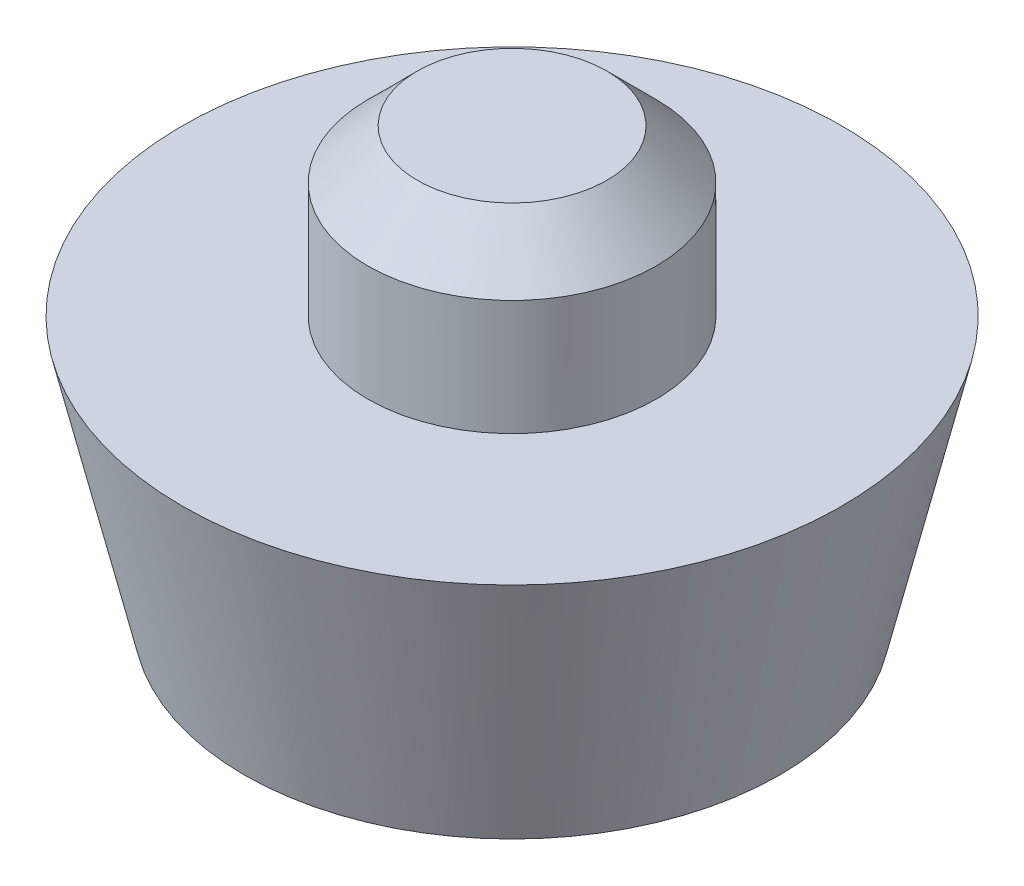
ISO-10303-21;
HEADER;
FILE_DESCRIPTION(('STEP AP214'),'2;1');
FILE_NAME('part.step','',(''),(''),'','','');
FILE_SCHEMA(('AUTOMOTIVE_DESIGN { 1 0 10303 214 1 1 1 1 }'));
ENDSEC;
DATA;
#1=APPLICATION_CONTEXT('core data for automotive mechanical design processes');
#2=APPLICATION_PROTOCOL_DEFINITION('international standard','automotive_design',2000,#1);
#3=PRODUCT_CONTEXT('',#1,'mechanical');
#4=PRODUCT('Part','Part','',(#3));
#5=PRODUCT_RELATED_PRODUCT_CATEGORY('part','',(#4));
#6=PRODUCT_DEFINITION_FORMATION('','',#4);
#7=PRODUCT_DEFINITION_CONTEXT('part definition',#1,'design');
#8=PRODUCT_DEFINITION('design','',#6,#7);
#9=PRODUCT_DEFINITION_SHAPE('','',#8);
#10=(LENGTH_UNIT() NAMED_UNIT(*) SI_UNIT(.MILLI.,.METRE.));
#11=(NAMED_UNIT(*) PLANE_ANGLE_UNIT() SI_UNIT($,.RADIAN.));
#12=(NAMED_UNIT(*) SI_UNIT($,.STERADIAN.) SOLID_ANGLE_UNIT());
#13=UNCERTAINTY_MEASURE_WITH_UNIT(LENGTH_MEASURE(1.E-05),#10,'distance_accuracy_value','');
#14=(GEOMETRIC_REPRESENTATION_CONTEXT(3) GLOBAL_UNCERTAINTY_ASSIGNED_CONTEXT((#13)) GLOBAL_UNIT_ASSIGNED_CONTEXT((#10,
#11,#12)) REPRESENTATION_CONTEXT('',''));
#15=CARTESIAN_POINT('',(0.,0.,0.));
#16=DIRECTION('',(0.,0.,1.));
#17=DIRECTION('',(1.,0.,0.));
#18=AXIS2_PLACEMENT_3D('',#15,#16,#17);
#19=CARTESIAN_POINT('',(-51.041194398403,-78.167296946049,-4.73));
#20=DIRECTION('',(0.,-1.,0.));
#21=DIRECTION('',(0.,0.,1.));
#22=AXIS2_PLACEMENT_3D('',#19,#20,#21);
#23=PLANE('',#22);
#24=CARTESIAN_POINT('',(-55.7711943984024,-78.1672969460494,5.76191659535264E-13));
#25=DIRECTION('',(0.,1.,-1.36023523358516E-13));
#26=DIRECTION('',(0.,1.36023523358516E-13,1.));
#27=AXIS2_PLACEMENT_3D('',#24,#25,#26);
#28=CIRCLE('',#27,4.30000000000064);
#29=CARTESIAN_POINT('',(-55.7711943984024,-78.1672969460489,4.30000000000122));
#30=VERTEX_POINT('',#29);
#31=EDGE_CURVE('E19',#30,#30,#28,.T.);
#32=ORIENTED_EDGE('',*,*,#31,.F.);
#33=EDGE_LOOP('',(#32));
#34=FACE_BOUND('',#33,.T.);
#35=ADVANCED_FACE('F15',(#34),#23,.T.);
#36=CARTESIAN_POINT('',(-58.301194398403,-66.967296946049,-2.53));
#37=DIRECTION('',(0.,1.,0.));
#38=DIRECTION('',(0.,0.,1.));
#39=AXIS2_PLACEMENT_3D('',#36,#37,#38);
#40=PLANE('',#39);
#41=CARTESIAN_POINT('',(-55.7711943984022,-66.9672969460494,3.84452430083598E-13));
#42=DIRECTION('',(0.,-1.,1.62536131825264E-13));
#43=DIRECTION('',(0.,-1.62536131825264E-13,-1.));
#44=AXIS2_PLACEMENT_3D('',#41,#42,#43);
#45=CIRCLE('',#44,2.30000000000098);
#46=CARTESIAN_POINT('',(-55.7711943984022,-66.9672969460498,-2.30000000000059));
#47=VERTEX_POINT('',#46);
#48=EDGE_CURVE('E39',#47,#47,#45,.T.);
#49=ORIENTED_EDGE('',*,*,#48,.F.);
#50=EDGE_LOOP('',(#49));
#51=FACE_BOUND('',#50,.T.);
#52=ADVANCED_FACE('F51',(#51),#40,.T.);
#53=CARTESIAN_POINT('',(-55.7711943984023,-77.4672969460495,4.8097519318432E-13));
#54=DIRECTION('',(0.,1.,-1.36023523358516E-13));
#55=DIRECTION('',(0.,1.36023523358516E-13,1.));
#56=AXIS2_PLACEMENT_3D('',#53,#54,#55);
#57=TOROIDAL_SURFACE('',#56,4.30000000000075,0.699999999999876);
#58=ORIENTED_EDGE('',*,*,#31,.T.);
#59=EDGE_LOOP('',(#58));
#60=FACE_BOUND('',#59,.T.);
#61=CARTESIAN_POINT('',(-55.7711943984023,-77.4672969460493,5.76842180838735E-13));
#62=DIRECTION('',(0.,1.,-1.15377761183006E-13));
#63=DIRECTION('',(0.,1.15377761183006E-13,1.));
#64=AXIS2_PLACEMENT_3D('',#61,#62,#63);
#65=CIRCLE('',#64,4.99999999999995);
#66=CARTESIAN_POINT('',(-55.7711943984023,-77.4672969460487,5.00000000000052));
#67=VERTEX_POINT('',#66);
#68=EDGE_CURVE('E31',#67,#67,#65,.T.);
#69=ORIENTED_EDGE('',*,*,#68,.F.);
#70=EDGE_LOOP('',(#69));
#71=FACE_BOUND('',#70,.T.);
#72=ADVANCED_FACE('F47',(#60,#71),#57,.T.);
#73=CARTESIAN_POINT('',(-55.7711943984023,-68.1672969460493,5.79495788273907E-13));
#74=DIRECTION('',(0.,-1.,1.62536131825264E-13));
#75=DIRECTION('',(0.,-1.62536131825264E-13,-1.));
#76=AXIS2_PLACEMENT_3D('',#73,#74,#75);
#77=CONICAL_SURFACE('',#76,3.5000000000007,0.785398163397353);
#78=CARTESIAN_POINT('',(-55.7711943984023,-68.1672969460493,5.79495788273908E-13));
#79=DIRECTION('',(0.,-1.,1.62536131825264E-13));
#80=DIRECTION('',(0.,-1.62536131825264E-13,-1.));
#81=AXIS2_PLACEMENT_3D('',#78,#79,#80);
#82=CIRCLE('',#81,3.49999999999994);
#83=CARTESIAN_POINT('',(-55.7711943984023,-68.1672969460499,-3.49999999999936));
#84=VERTEX_POINT('',#83);
#85=EDGE_CURVE('E38',#84,#84,#82,.T.);
#86=ORIENTED_EDGE('',*,*,#85,.F.);
#87=EDGE_LOOP('',(#86));
#88=FACE_BOUND('',#87,.T.);
#89=ORIENTED_EDGE('',*,*,#48,.T.);
#90=EDGE_LOOP('',(#89));
#91=FACE_BOUND('',#90,.T.);
#92=ADVANCED_FACE('F82',(#88,#91),#77,.T.);
#93=CARTESIAN_POINT('',(-55.7711943984023,-77.4672969460493,5.76842180838735E-13));
#94=DIRECTION('',(0.,1.,-1.15377761183006E-13));
#95=DIRECTION('',(0.,1.15377761183006E-13,1.));
#96=AXIS2_PLACEMENT_3D('',#93,#94,#95);
#97=CYLINDRICAL_SURFACE('',#96,4.99999999999995);
#98=ORIENTED_EDGE('',*,*,#68,.T.);
#99=EDGE_LOOP('',(#98));
#100=FACE_BOUND('',#99,.T.);
#101=CARTESIAN_POINT('',(-55.7711943984023,-77.3672969460513,5.65304404720667E-13));
#102=DIRECTION('',(0.,1.,-1.15377761183006E-13));
#103=DIRECTION('',(0.,1.15377761183006E-13,1.));
#104=AXIS2_PLACEMENT_3D('',#101,#102,#103);
#105=CIRCLE('',#104,4.99999999999995);
#106=CARTESIAN_POINT('',(-55.7711943984023,-77.3672969460508,5.00000000000051));
#107=VERTEX_POINT('',#106);
#108=EDGE_CURVE('E36',#107,#107,#105,.T.);
#109=ORIENTED_EDGE('',*,*,#108,.F.);
#110=EDGE_LOOP('',(#109));
#111=FACE_BOUND('',#110,.T.);
#112=ADVANCED_FACE('F76',(#100,#111),#97,.T.);
#113=CARTESIAN_POINT('',(-55.7711943984023,-70.9672969460493,5.79495788273908E-13));
#114=DIRECTION('',(0.,1.,-1.62536131825264E-13));
#115=DIRECTION('',(0.,1.62536131825264E-13,1.));
#116=AXIS2_PLACEMENT_3D('',#113,#114,#115);
#117=CYLINDRICAL_SURFACE('',#116,3.49999999999994);
#118=CARTESIAN_POINT('',(-55.7711943984023,-70.9672969460493,5.79495788273907E-13));
#119=DIRECTION('',(0.,1.,-1.62536131825264E-13));
#120=DIRECTION('',(0.,1.62536131825264E-13,1.));
#121=AXIS2_PLACEMENT_3D('',#118,#119,#120);
#122=CIRCLE('',#121,3.49999999999994);
#123=CARTESIAN_POINT('',(-55.7711943984023,-70.9672969460488,3.50000000000052));
#124=VERTEX_POINT('',#123);
#125=EDGE_CURVE('E28',#124,#124,#122,.F.);
#126=ORIENTED_EDGE('',*,*,#125,.F.);
#127=EDGE_LOOP('',(#126));
#128=FACE_BOUND('',#127,.T.);
#129=ORIENTED_EDGE('',*,*,#85,.T.);
#130=EDGE_LOOP('',(#129));
#131=FACE_BOUND('',#130,.T.);
#132=ADVANCED_FACE('F70',(#128,#131),#117,.T.);
#133=CARTESIAN_POINT('',(-48.621194398403,-77.367296946051,-7.15));
#134=DIRECTION('',(0.,-1.,0.));
#135=DIRECTION('',(0.,0.,1.));
#136=AXIS2_PLACEMENT_3D('',#133,#134,#135);
#137=PLANE('',#136);
#138=ORIENTED_EDGE('',*,*,#108,.T.);
#139=EDGE_LOOP('',(#138));
#140=FACE_BOUND('',#139,.T.);
#141=CARTESIAN_POINT('',(-55.7711943984023,-77.3672969460513,5.76842180838729E-13));
#142=DIRECTION('',(0.,1.,0.));
#143=DIRECTION('',(0.,0.,1.));
#144=AXIS2_PLACEMENT_3D('',#141,#142,#143);
#145=CIRCLE('',#144,6.50000000000073);
#146=CARTESIAN_POINT('',(-55.7711943984023,-77.3672969460508,6.5000000000013));
#147=VERTEX_POINT('',#146);
#148=EDGE_CURVE('E23',#147,#147,#145,.T.);
#149=ORIENTED_EDGE('',*,*,#148,.F.);
#150=EDGE_LOOP('',(#149));
#151=FACE_BOUND('',#150,.T.);
#152=ADVANCED_FACE('F65',(#140,#151),#137,.T.);
#153=CARTESIAN_POINT('',(-64.571194398403,-70.967296946049,-8.8));
#154=DIRECTION('',(0.,1.,0.));
#155=DIRECTION('',(0.,0.,1.));
#156=AXIS2_PLACEMENT_3D('',#153,#154,#155);
#157=PLANE('',#156);
#158=ORIENTED_EDGE('',*,*,#125,.T.);
#159=EDGE_LOOP('',(#158));
#160=FACE_BOUND('',#159,.T.);
#161=CARTESIAN_POINT('',(-55.7711943984019,-70.9672969460494,0.));
#162=DIRECTION('',(0.,1.,0.));
#163=DIRECTION('',(0.,0.,1.));
#164=AXIS2_PLACEMENT_3D('',#161,#162,#163);
#165=CIRCLE('',#164,8.00000000000105);
#166=CARTESIAN_POINT('',(-55.7711943984019,-70.9672969460487,8.00000000000106));
#167=VERTEX_POINT('',#166);
#168=EDGE_CURVE('E10',#167,#167,#165,.F.);
#169=ORIENTED_EDGE('',*,*,#168,.F.);
#170=EDGE_LOOP('',(#169));
#171=FACE_BOUND('',#170,.T.);
#172=ADVANCED_FACE('F60',(#160,#171),#157,.T.);
#173=CARTESIAN_POINT('',(-55.7711943984023,-77.3672969460513,5.76842180838729E-13));
#174=DIRECTION('',(0.,1.,0.));
#175=DIRECTION('',(0.,0.,1.));
#176=AXIS2_PLACEMENT_3D('',#173,#174,#175);
#177=CONICAL_SURFACE('',#176,6.50000000000073,0.230219587276825);
#178=ORIENTED_EDGE('',*,*,#148,.T.);
#179=EDGE_LOOP('',(#178));
#180=FACE_BOUND('',#179,.T.);
#181=ORIENTED_EDGE('',*,*,#168,.T.);
#182=EDGE_LOOP('',(#181));
#183=FACE_BOUND('',#182,.T.);
#184=ADVANCED_FACE('F17',(#180,#183),#177,.T.);
#185=CLOSED_SHELL('',(#35,#52,#72,#92,#112,#132,#152,#172,#184));
#186=MANIFOLD_SOLID_BREP('B1',#185);
#187=ADVANCED_BREP_SHAPE_REPRESENTATION('',(#18,#186),#14);
#188=SHAPE_DEFINITION_REPRESENTATION(#9,#187);
ENDSEC;
END-ISO-10303-21;
